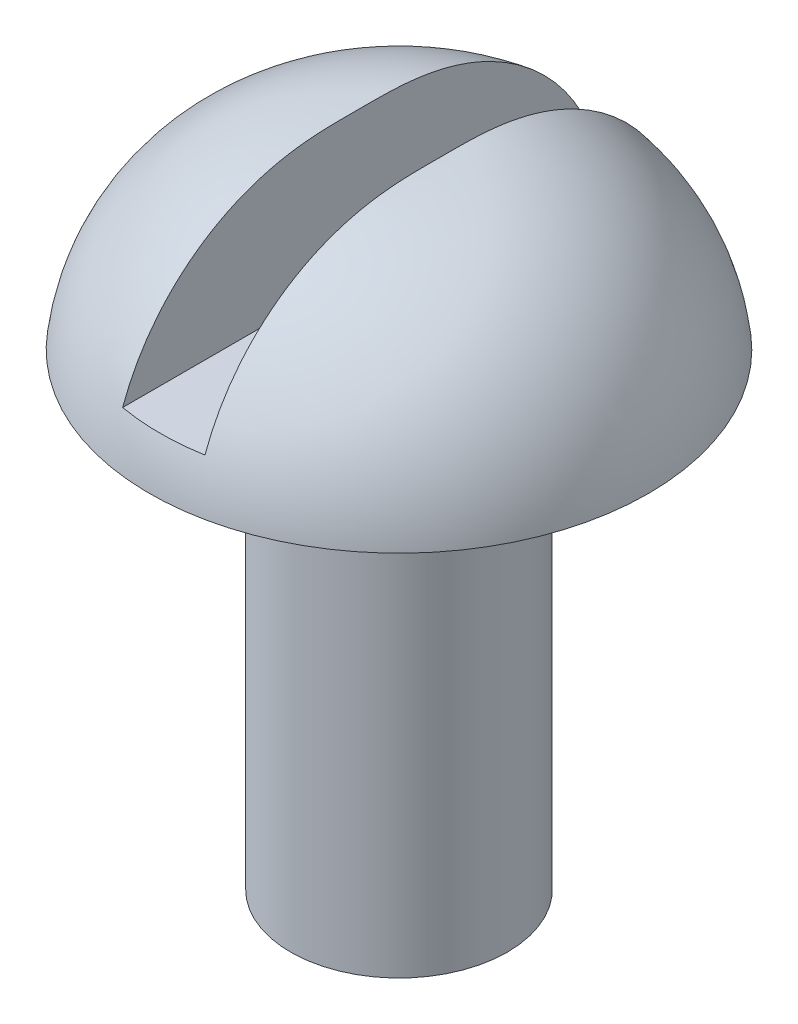
ISO-10303-21;
HEADER;
FILE_DESCRIPTION(('STEP AP214'),'2;1');
FILE_NAME('part.step','',(''),(''),'','','');
FILE_SCHEMA(('AUTOMOTIVE_DESIGN { 1 0 10303 214 1 1 1 1 }'));
ENDSEC;
DATA;
#1=APPLICATION_CONTEXT('core data for automotive mechanical design processes');
#2=APPLICATION_PROTOCOL_DEFINITION('international standard','automotive_design',2000,#1);
#3=PRODUCT_CONTEXT('',#1,'mechanical');
#4=PRODUCT('Part','Part','',(#3));
#5=PRODUCT_RELATED_PRODUCT_CATEGORY('part','',(#4));
#6=PRODUCT_DEFINITION_FORMATION('','',#4);
#7=PRODUCT_DEFINITION_CONTEXT('part definition',#1,'design');
#8=PRODUCT_DEFINITION('design','',#6,#7);
#9=PRODUCT_DEFINITION_SHAPE('','',#8);
#10=(LENGTH_UNIT() NAMED_UNIT(*) SI_UNIT(.MILLI.,.METRE.));
#11=(NAMED_UNIT(*) PLANE_ANGLE_UNIT() SI_UNIT($,.RADIAN.));
#12=(NAMED_UNIT(*) SI_UNIT($,.STERADIAN.) SOLID_ANGLE_UNIT());
#13=UNCERTAINTY_MEASURE_WITH_UNIT(LENGTH_MEASURE(1.E-05),#10,'distance_accuracy_value','');
#14=(GEOMETRIC_REPRESENTATION_CONTEXT(3) GLOBAL_UNCERTAINTY_ASSIGNED_CONTEXT((#13)) GLOBAL_UNIT_ASSIGNED_CONTEXT((#10,
#11,#12)) REPRESENTATION_CONTEXT('',''));
#15=CARTESIAN_POINT('',(0.,0.,0.));
#16=DIRECTION('',(0.,0.,1.));
#17=DIRECTION('',(1.,0.,0.));
#18=AXIS2_PLACEMENT_3D('',#15,#16,#17);
#19=CARTESIAN_POINT('',(0.,-20.32,0.));
#20=DIRECTION('',(0.,-1.,0.));
#21=DIRECTION('',(1.,0.,0.));
#22=AXIS2_PLACEMENT_3D('',#19,#20,#21);
#23=PLANE('',#22);
#24=CARTESIAN_POINT('',(0.,-20.32,0.));
#25=DIRECTION('',(0.,-1.,0.));
#26=DIRECTION('',(1.,0.,0.));
#27=AXIS2_PLACEMENT_3D('',#24,#25,#26);
#28=CIRCLE('',#27,11.781869772002);
#29=CARTESIAN_POINT('',(11.781869772002,-20.32,0.));
#30=VERTEX_POINT('',#29);
#31=EDGE_CURVE('E72',#30,#30,#28,.T.);
#32=ORIENTED_EDGE('',*,*,#31,.F.);
#33=EDGE_LOOP('',(#32));
#34=FACE_BOUND('',#33,.T.);
#35=CARTESIAN_POINT('',(0.,-20.32,0.));
#36=DIRECTION('',(0.,-1.,0.));
#37=DIRECTION('',(1.,0.,0.));
#38=AXIS2_PLACEMENT_3D('',#35,#36,#37);
#39=CIRCLE('',#38,27.1010153402487);
#40=CARTESIAN_POINT('',(27.1010153402487,-20.32,0.));
#41=VERTEX_POINT('',#40);
#42=EDGE_CURVE('E101',#41,#41,#39,.T.);
#43=ORIENTED_EDGE('',*,*,#42,.T.);
#44=EDGE_LOOP('',(#43));
#45=FACE_BOUND('',#44,.T.);
#46=ADVANCED_FACE('F16',(#34,#45),#23,.T.);
#47=CARTESIAN_POINT('',(0.,-71.12,0.));
#48=DIRECTION('',(0.,1.,0.));
#49=DIRECTION('',(0.,0.,1.));
#50=AXIS2_PLACEMENT_3D('',#47,#48,#49);
#51=CYLINDRICAL_SURFACE('',#50,11.781869772002);
#52=CARTESIAN_POINT('',(0.,-71.12,0.));
#53=DIRECTION('',(0.,-1.,0.));
#54=DIRECTION('',(1.,0.,0.));
#55=AXIS2_PLACEMENT_3D('',#52,#53,#54);
#56=CIRCLE('',#55,11.781869772002);
#57=CARTESIAN_POINT('',(11.781869772002,-71.12,0.));
#58=VERTEX_POINT('',#57);
#59=EDGE_CURVE('E102',#58,#58,#56,.T.);
#60=ORIENTED_EDGE('',*,*,#59,.F.);
#61=EDGE_LOOP('',(#60));
#62=FACE_BOUND('',#61,.T.);
#63=ORIENTED_EDGE('',*,*,#31,.T.);
#64=EDGE_LOOP('',(#63));
#65=FACE_BOUND('',#64,.T.);
#66=ADVANCED_FACE('F87',(#62,#65),#51,.T.);
#67=CARTESIAN_POINT('',(0.,-71.12,0.));
#68=DIRECTION('',(0.,-1.,0.));
#69=DIRECTION('',(1.,0.,0.));
#70=AXIS2_PLACEMENT_3D('',#67,#68,#69);
#71=PLANE('',#70);
#72=ORIENTED_EDGE('',*,*,#59,.T.);
#73=EDGE_LOOP('',(#72));
#74=FACE_BOUND('',#73,.T.);
#75=ADVANCED_FACE('F84',(#74),#71,.T.);
#76=CARTESIAN_POINT('',(0.,-22.86,0.));
#77=DIRECTION('',(0.,1.,0.));
#78=DIRECTION('',(0.,0.,1.));
#79=AXIS2_PLACEMENT_3D('',#76,#77,#78);
#80=DEGENERATE_TOROIDAL_SURFACE('',#79,4.38256468885079,22.86,.T.);
#81=CARTESIAN_POINT('',(0.,-15.24,0.));
#82=DIRECTION('',(0.,-1.,0.));
#83=DIRECTION('',(0.,0.,-1.));
#84=AXIS2_PLACEMENT_3D('',#81,#82,#83);
#85=CIRCLE('',#84,25.9351793794168);
#86=CARTESIAN_POINT('',(-4.47057440816206,-15.24,25.5469664325064));
#87=VERTEX_POINT('',#86);
#88=CARTESIAN_POINT('',(4.47057440816206,-15.24,25.5469664325064));
#89=VERTEX_POINT('',#88);
#90=EDGE_CURVE('E10',#87,#89,#85,.F.);
#91=ORIENTED_EDGE('',*,*,#90,.F.);
#92=CARTESIAN_POINT('',(-4.47057440816206,-0.000169416872163819,0.));
#93=CARTESIAN_POINT('',(-4.47057440816206,-0.000170004205082616,-0.186452177686282));
#94=CARTESIAN_POINT('',(-4.47057440816206,-0.000205692443229249,-0.372904313040872));
#95=CARTESIAN_POINT('',(-4.47057440816206,-0.000454693663221782,-0.745808897814872));
#96=CARTESIAN_POINT('',(-4.47057440816206,-0.000668007048835807,-0.932261347234033));
#97=CARTESIAN_POINT('',(-4.47057440816206,-0.00156345430051884,-1.30513529458505));
#98=CARTESIAN_POINT('',(-4.47057440816206,-0.00224551167664613,-1.49155679260391));
#99=CARTESIAN_POINT('',(-4.47057440816206,-0.00449552504806426,-1.86439462540654));
#100=CARTESIAN_POINT('',(-4.47057440816206,-0.0060634838066091,-2.05081096017239));
#101=CARTESIAN_POINT('',(-4.47057440816206,-0.0128159677570617,-2.60961580620854));
#102=CARTESIAN_POINT('',(-4.47057440816206,-0.0200479901937869,-2.98198767227257));
#103=CARTESIAN_POINT('',(-4.47057440816206,-0.043668259838029,-3.72655256883429));
#104=CARTESIAN_POINT('',(-4.47057440816206,-0.0600585991893079,-4.09874553901332));
#105=CARTESIAN_POINT('',(-4.47057440816206,-0.105283512364211,-4.84978964795365));
#106=CARTESIAN_POINT('',(-4.47057440816206,-0.134357761324207,-5.2286269058061));
#107=CARTESIAN_POINT('',(-4.47057440816206,-0.207026278260372,-5.98493660083577));
#108=CARTESIAN_POINT('',(-4.47057440816206,-0.250620878977985,-6.36240900653628));
#109=CARTESIAN_POINT('',(-4.47057440816206,-0.353635006430786,-7.11523404953914));
#110=CARTESIAN_POINT('',(-4.47057440816206,-0.413055760064203,-7.49058652019193));
#111=CARTESIAN_POINT('',(-4.47057440816206,-0.548513786741311,-8.23828016884625));
#112=CARTESIAN_POINT('',(-4.47057440816206,-0.624550543506945,-8.61062144003648));
#113=CARTESIAN_POINT('',(-4.47057440816206,-0.793706388881691,-9.35147183057077));
#114=CARTESIAN_POINT('',(-4.47057440816206,-0.886828084066857,-9.71998035609172));
#115=CARTESIAN_POINT('',(-4.47057440816206,-1.09035728238853,-10.4521980166407));
#116=CARTESIAN_POINT('',(-4.47057440816206,-1.20076487214968,-10.8159071276076));
#117=CARTESIAN_POINT('',(-4.47057440816206,-1.43891660133097,-11.5376386527031));
#118=CARTESIAN_POINT('',(-4.47057440816206,-1.5666616267187,-11.8956607751735));
#119=CARTESIAN_POINT('',(-4.47057440816206,-1.83938296481012,-12.6050896836016));
#120=CARTESIAN_POINT('',(-4.47057440816206,-1.98436099256281,-12.9564958070892));
#121=CARTESIAN_POINT('',(-4.47057440816206,-2.43081453179439,-13.9675593158506));
#122=CARTESIAN_POINT('',(-4.47057440816206,-2.75487298939021,-14.6174254457299));
#123=CARTESIAN_POINT('',(-4.47057440816206,-3.4628682995084,-15.8835298228238));
#124=CARTESIAN_POINT('',(-4.47057440816206,-3.84680246240835,-16.4997695788608));
#125=CARTESIAN_POINT('',(-4.47057440816206,-4.67186700080576,-17.6934819960324));
#126=CARTESIAN_POINT('',(-4.47057440816206,-5.11304406192031,-18.2709224236357));
#127=CARTESIAN_POINT('',(-4.47057440816206,-6.04854103939,-19.3809772503316));
#128=CARTESIAN_POINT('',(-4.47057440816206,-6.54285663242633,-19.9135952898701));
#129=CARTESIAN_POINT('',(-4.47057440816206,-7.52198667171331,-20.8720097942339));
#130=CARTESIAN_POINT('',(-4.47057440816206,-8.00164716730315,-21.3030869567219));
#131=CARTESIAN_POINT('',(-4.47057440816206,-8.99593686185243,-22.1227640840127));
#132=CARTESIAN_POINT('',(-4.47057440816206,-9.51056267258211,-22.5113681550753));
#133=CARTESIAN_POINT('',(-4.47057440816206,-10.5707014778889,-23.242960338425));
#134=CARTESIAN_POINT('',(-4.47057440816206,-11.1161910699646,-23.5859823696045));
#135=CARTESIAN_POINT('',(-4.47057440816206,-12.2344738127243,-24.2242165130004));
#136=CARTESIAN_POINT('',(-4.47057440816206,-12.8072673776157,-24.5194278996195));
#137=CARTESIAN_POINT('',(-4.47057440816206,-13.9690243808801,-25.0566239027366));
#138=CARTESIAN_POINT('',(-4.47057440816206,-14.557714568694,-25.2991996721796));
#139=CARTESIAN_POINT('',(-4.47057440816206,-15.75347342246,-25.7337630376496));
#140=CARTESIAN_POINT('',(-4.47057440816206,-16.3605418336365,-25.9257513346079));
#141=CARTESIAN_POINT('',(-4.47057440816206,-17.5888167963481,-26.2577743051329));
#142=CARTESIAN_POINT('',(-4.47057440816206,-18.2100253599429,-26.3978015352767));
#143=CARTESIAN_POINT('',(-4.47057440816206,-19.4620569228044,-26.6248485726858));
#144=CARTESIAN_POINT('',(-4.47057440816206,-20.0928799360197,-26.7118683030403));
#145=CARTESIAN_POINT('',(-4.47057440816206,-21.3577229730477,-26.8320882293953));
#146=CARTESIAN_POINT('',(-4.47057440816206,-21.9917277365108,-26.8654490390634));
#147=CARTESIAN_POINT('',(-4.47057440816206,-23.2602916572682,-26.8786128457719));
#148=CARTESIAN_POINT('',(-4.47057440816206,-23.8948508128927,-26.8584160035685));
#149=CARTESIAN_POINT('',(-4.47057440816206,-25.1600685254473,-26.7646058797107));
#150=CARTESIAN_POINT('',(-4.47057440816206,-25.7907267075013,-26.6909875423766));
#151=CARTESIAN_POINT('',(-4.47057440816206,-27.0435947936992,-26.4908595465712));
#152=CARTESIAN_POINT('',(-4.47057440816206,-27.6658046905106,-26.3643498421981));
#153=CARTESIAN_POINT('',(-4.47057440816206,-28.8971617664622,-26.0593983378695));
#154=CARTESIAN_POINT('',(-4.47057440816206,-29.5063129004535,-25.8809725062779));
#155=CARTESIAN_POINT('',(-4.47057440816206,-30.7074253747017,-25.4734599720728));
#156=CARTESIAN_POINT('',(-4.47057440816206,-31.2993867431081,-25.2443733524257));
#157=CARTESIAN_POINT('',(-4.47057440816206,-32.4616207760554,-24.7373237132641));
#158=CARTESIAN_POINT('',(-4.47057440816206,-33.0319046878792,-24.4593864726619));
#159=CARTESIAN_POINT('',(-4.47057440816206,-34.1470888873559,-23.8565540022517));
#160=CARTESIAN_POINT('',(-4.47057440816206,-34.6919891158624,-23.5316586630342));
#161=CARTESIAN_POINT('',(-4.47057440816206,-35.7528786690841,-22.8370500745163));
#162=CARTESIAN_POINT('',(-4.47057440816206,-36.2688512318321,-22.4673112254747));
#163=CARTESIAN_POINT('',(-4.47057440816206,-37.2679335475463,-21.6858320871883));
#164=CARTESIAN_POINT('',(-4.47057440816206,-37.7510435547614,-21.2740921229567));
#165=CARTESIAN_POINT('',(-4.47057440816206,-38.6818304658243,-20.4108569513829));
#166=CARTESIAN_POINT('',(-4.47057440816206,-39.1294470900964,-19.9592967508529));
#167=CARTESIAN_POINT('',(-4.47057440816206,-39.9852946382239,-19.0202607345146));
#168=CARTESIAN_POINT('',(-4.47057440816206,-40.393524369047,-18.5327838315746));
#169=CARTESIAN_POINT('',(-4.47057440816206,-41.1700691702907,-17.52255849066));
#170=CARTESIAN_POINT('',(-4.47057440816206,-41.5381421034045,-16.9996239368014));
#171=CARTESIAN_POINT('',(-4.47057440816206,-42.229247065789,-15.9248627512127));
#172=CARTESIAN_POINT('',(-4.47057440816206,-42.5522825910171,-15.3730383665888));
#173=CARTESIAN_POINT('',(-4.47057440816206,-43.1500290513962,-14.2470731668124));
#174=CARTESIAN_POINT('',(-4.47057440816206,-43.4249554481976,-13.673046686241));
#175=CARTESIAN_POINT('',(-4.47057440816206,-43.9269682929392,-12.5043512740191));
#176=CARTESIAN_POINT('',(-4.47057440816206,-44.1540454190374,-11.9096783463289));
#177=CARTESIAN_POINT('',(-4.47057440816206,-44.562584272311,-10.6951374781728));
#178=CARTESIAN_POINT('',(-4.47057440816206,-44.743331438014,-10.0750284250964));
#179=CARTESIAN_POINT('',(-4.47057440816206,-44.9771676180665,-9.13592122194589));
#180=CARTESIAN_POINT('',(-4.47057440816206,-45.0488923036118,-8.82143461255371));
#181=CARTESIAN_POINT('',(-4.47057440816206,-45.1801660246338,-8.18993475593902));
#182=CARTESIAN_POINT('',(-4.47057440816206,-45.2397158378164,-7.87292167144742));
#183=CARTESIAN_POINT('',(-4.47057440816206,-45.3473581972449,-7.23463835354108));
#184=CARTESIAN_POINT('',(-4.47057440816206,-45.395365845449,-6.91335388654686));
#185=CARTESIAN_POINT('',(-4.47057440816206,-45.4799269040816,-6.26928596483018));
#186=CARTESIAN_POINT('',(-4.47057440816206,-45.5164802244803,-5.94650249834599));
#187=CARTESIAN_POINT('',(-4.47057440816206,-45.5789811390182,-5.29979670376044));
#188=CARTESIAN_POINT('',(-4.47057440816206,-45.6049246331834,-4.97587398409194));
#189=CARTESIAN_POINT('',(-4.47057440816206,-45.6474148570386,-4.32740622145068));
#190=CARTESIAN_POINT('',(-4.47057440816206,-45.6639609999151,-4.0028611408843));
#191=CARTESIAN_POINT('',(-4.47057440816206,-45.686740049864,-3.4214152067193));
#192=CARTESIAN_POINT('',(-4.47057440816206,-45.6944063612158,-3.16456700730571));
#193=CARTESIAN_POINT('',(-4.47057440816206,-45.7060627524341,-2.6507982953286));
#194=CARTESIAN_POINT('',(-4.47057440816206,-45.7100529294302,-2.39387778485509));
#195=CARTESIAN_POINT('',(-4.47057440816206,-45.7156081266242,-1.87997889446629));
#196=CARTESIAN_POINT('',(-4.47057440816206,-45.7171728065651,-1.62300051148875));
#197=CARTESIAN_POINT('',(-4.47057440816206,-45.7190958647419,-1.10903961595809));
#198=CARTESIAN_POINT('',(-4.47057440816206,-45.7194542373229,-0.852057103391243));
#199=CARTESIAN_POINT('',(-4.47057440816206,-45.71983548606,-0.337837540965433));
#200=CARTESIAN_POINT('',(-4.47057440816206,-45.7198580295561,-0.080600491109681));
#201=CARTESIAN_POINT('',(-4.47057440816206,-45.7197757456641,0.43387360062501));
#202=CARTESIAN_POINT('',(-4.47057440816206,-45.7196709182843,0.691110642503948));
#203=CARTESIAN_POINT('',(-4.47057440816206,-45.718791323845,1.20558714532913));
#204=CARTESIAN_POINT('',(-4.47057440816206,-45.7180165493429,1.46282660627051));
#205=CARTESIAN_POINT('',(-4.47057440816206,-45.7147191082457,1.9772936831153));
#206=CARTESIAN_POINT('',(-4.47057440816206,-45.7121964648336,2.23452129913058));
#207=CARTESIAN_POINT('',(-4.47057440816206,-45.7041569676624,2.74736511903117));
#208=CARTESIAN_POINT('',(-4.47057440816206,-45.6986584729441,3.00298158084349));
#209=CARTESIAN_POINT('',(-4.47057440816206,-45.6834997392684,3.51409531790868));
#210=CARTESIAN_POINT('',(-4.47057440816206,-45.6738395281105,3.76959259394626));
#211=CARTESIAN_POINT('',(-4.47057440816206,-45.6493664540808,4.28032432045553));
#212=CARTESIAN_POINT('',(-4.47057440816206,-45.6345540356147,4.53555879169176));
#213=CARTESIAN_POINT('',(-4.47057440816206,-45.5989959071053,5.04561964718657));
#214=CARTESIAN_POINT('',(-4.47057440816206,-45.5782501821165,5.30044603041559));
#215=CARTESIAN_POINT('',(-4.47057440816206,-45.5302877476094,5.80889812823799));
#216=CARTESIAN_POINT('',(-4.47057440816206,-45.5030861862883,6.06252525686809));
#217=CARTESIAN_POINT('',(-4.47057440816206,-45.4417553268886,6.56894180680948));
#218=CARTESIAN_POINT('',(-4.47057440816206,-45.4076258944958,6.82173121178279));
#219=CARTESIAN_POINT('',(-4.47057440816206,-45.2943534712782,7.57844065436681));
#220=CARTESIAN_POINT('',(-4.47057440816206,-45.2043195329927,8.08077659881853));
#221=CARTESIAN_POINT('',(-4.47057440816206,-44.9638434350521,9.22025259699726));
#222=CARTESIAN_POINT('',(-4.47057440816206,-44.8035181599196,9.85533720186964));
#223=CARTESIAN_POINT('',(-4.47057440816206,-44.4312165385839,11.1109455216703));
#224=CARTESIAN_POINT('',(-4.47057440816206,-44.2191852262666,11.7314529656299));
#225=CARTESIAN_POINT('',(-4.47057440816206,-43.743887533123,12.9525350234402));
#226=CARTESIAN_POINT('',(-4.47057440816206,-43.480622810016,13.5531102814852));
#227=CARTESIAN_POINT('',(-4.47057440816206,-42.9041919993033,14.7295201579158));
#228=CARTESIAN_POINT('',(-4.47057440816206,-42.5910468290539,15.3053650190408));
#229=CARTESIAN_POINT('',(-4.47057440816206,-41.9162032976617,16.4289331312445));
#230=CARTESIAN_POINT('',(-4.47057440816206,-41.5544402185078,16.9766175291932));
#231=CARTESIAN_POINT('',(-4.47057440816206,-40.7850481550955,18.0389035279089));
#232=CARTESIAN_POINT('',(-4.47057440816206,-40.3774119086646,18.5534998701924));
#233=CARTESIAN_POINT('',(-4.47057440816206,-39.5189005596729,19.5458986495694));
#234=CARTESIAN_POINT('',(-4.47057440816206,-39.0679954475349,20.0236751296647));
#235=CARTESIAN_POINT('',(-4.47057440816206,-38.1264953551839,20.9383212218137));
#236=CARTESIAN_POINT('',(-4.47057440816206,-37.6359030352731,21.3751935715138));
#237=CARTESIAN_POINT('',(-4.47057440816206,-36.6309961537652,22.1946182536935));
#238=CARTESIAN_POINT('',(-4.47057440816206,-36.1175463088944,22.5782316028267));
#239=CARTESIAN_POINT('',(-4.47057440816206,-35.0599509947343,23.3005215999393));
#240=CARTESIAN_POINT('',(-4.47057440816206,-34.5158055916012,23.6391983447626));
#241=CARTESIAN_POINT('',(-4.47057440816206,-33.4009744143298,24.268980882864));
#242=CARTESIAN_POINT('',(-4.47057440816206,-32.8303007495225,24.5601081123625));
#243=CARTESIAN_POINT('',(-4.47057440816206,-31.6662894102701,25.0928398014835));
#244=CARTESIAN_POINT('',(-4.47057440816206,-31.0729518609561,25.3344445344809));
#245=CARTESIAN_POINT('',(-4.47057440816206,-29.8722525446422,25.7647961971003));
#246=CARTESIAN_POINT('',(-4.47057440816206,-29.2650232057606,25.9539126975866));
#247=CARTESIAN_POINT('',(-4.47057440816206,-28.0367712089616,26.2802221825116));
#248=CARTESIAN_POINT('',(-4.47057440816206,-27.4157486144014,26.4174154053996));
#249=CARTESIAN_POINT('',(-4.47057440816206,-26.1642737060952,26.6388977404555));
#250=CARTESIAN_POINT('',(-4.47057440816206,-25.5338204203864,26.7231813605568));
#251=CARTESIAN_POINT('',(-4.47057440816206,-24.2680481402891,26.8382122018814));
#252=CARTESIAN_POINT('',(-4.47057440816206,-23.6327291471752,26.8689594371299));
#253=CARTESIAN_POINT('',(-4.47057440816206,-22.3631211802342,26.8766869138209));
#254=CARTESIAN_POINT('',(-4.47057440816206,-21.7288329007629,26.8537817285592));
#255=CARTESIAN_POINT('',(-4.47057440816206,-20.4644429943957,26.7546071013322));
#256=CARTESIAN_POINT('',(-4.47057440816206,-19.8343413598159,26.6783377573349));
#257=CARTESIAN_POINT('',(-4.47057440816206,-18.5827678838611,26.4729784460571));
#258=CARTESIAN_POINT('',(-4.47057440816206,-17.9612965469124,26.3438854046439));
#259=CARTESIAN_POINT('',(-4.47057440816206,-16.7314368216321,26.0338087917022));
#260=CARTESIAN_POINT('',(-4.47057440816206,-16.1230484397613,25.8528251945486));
#261=CARTESIAN_POINT('',(-4.47057440816206,-14.9236366039123,25.440259379808));
#262=CARTESIAN_POINT('',(-4.47057440816206,-14.33261419563,25.208674122285));
#263=CARTESIAN_POINT('',(-4.47057440816206,-13.1721595722817,24.6965805484789));
#264=CARTESIAN_POINT('',(-4.47057440816206,-12.6027273517796,24.4160722445137));
#265=CARTESIAN_POINT('',(-4.47057440816206,-11.4896849686147,23.808268646203));
#266=CARTESIAN_POINT('',(-4.47057440816206,-10.9460651892813,23.480990961364));
#267=CARTESIAN_POINT('',(-4.47057440816206,-9.88824172181249,22.7819272444299));
#268=CARTESIAN_POINT('',(-4.47057440816206,-9.37403800926037,22.4101412492797));
#269=CARTESIAN_POINT('',(-4.47057440816206,-8.3779999680845,21.6242335855948));
#270=CARTESIAN_POINT('',(-4.47057440816206,-7.89620802981295,21.210058195178));
#271=CARTESIAN_POINT('',(-4.47057440816206,-6.96906077433031,20.3427577870305));
#272=CARTESIAN_POINT('',(-4.47057440816206,-6.52370559904101,19.889632617604));
#273=CARTESIAN_POINT('',(-4.47057440816206,-5.6719604768977,18.9471290002411));
#274=CARTESIAN_POINT('',(-4.47057440816206,-5.26561874079087,18.457706988696));
#275=CARTESIAN_POINT('',(-4.47057440816206,-4.49524010380437,17.4466413409541));
#276=CARTESIAN_POINT('',(-4.47057440816206,-4.13120299004134,16.9249978669208));
#277=CARTESIAN_POINT('',(-4.47057440816206,-3.44536006001159,15.8494821109725));
#278=CARTESIAN_POINT('',(-4.47057440816206,-3.12386942612751,15.2954088801333));
#279=CARTESIAN_POINT('',(-4.47057440816206,-2.528080703319,14.1624457718962));
#280=CARTESIAN_POINT('',(-4.47057440816206,-2.25378329423211,13.5835555371492));
#281=CARTESIAN_POINT('',(-4.47057440816206,-1.75464666877162,12.4073043400779));
#282=CARTESIAN_POINT('',(-4.47057440816206,-1.52963463817306,11.8100165745212));
#283=CARTESIAN_POINT('',(-4.47057440816206,-1.12846675187609,10.5992362745719));
#284=CARTESIAN_POINT('',(-4.47057440816206,-0.952310496155646,9.98574387290474));
#285=CARTESIAN_POINT('',(-4.47057440816206,-0.7069858905462,8.98571541112922));
#286=CARTESIAN_POINT('',(-4.47057440816206,-0.622744881741779,8.60279532720849));
#287=CARTESIAN_POINT('',(-4.47057440816206,-0.472124208194983,7.83342629205598));
#288=CARTESIAN_POINT('',(-4.47057440816206,-0.40574542537085,7.44697716755721));
#289=CARTESIAN_POINT('',(-4.47057440816206,-0.29012048244552,6.67152395091615));
#290=CARTESIAN_POINT('',(-4.47057440816206,-0.240875312559836,6.28251971242762));
#291=CARTESIAN_POINT('',(-4.47057440816206,-0.158263227803852,5.50286589884088));
#292=CARTESIAN_POINT('',(-4.47057440816206,-0.124895676231502,5.11221639035287));
#293=CARTESIAN_POINT('',(-4.47057440816206,-0.0719087489282535,4.32845374322309));
#294=CARTESIAN_POINT('',(-4.47057440816206,-0.0523446520249086,3.93533698887939));
#295=CARTESIAN_POINT('',(-4.47057440816206,-0.0240690244734425,3.14872354825914));
#296=CARTESIAN_POINT('',(-4.47057440816206,-0.015358180696116,2.75522683951339));
#297=CARTESIAN_POINT('',(-4.47057440816206,-0.00448702181003184,1.96810227269197));
#298=CARTESIAN_POINT('',(-4.47057440816206,-0.00232780320880698,1.57447440368873));
#299=CARTESIAN_POINT('',(-4.47057440816206,-0.000746991571829426,0.984039488685567));
#300=CARTESIAN_POINT('',(-4.47057440816206,-0.000496382421477805,0.787231714638979));
#301=CARTESIAN_POINT('',(-4.47057440816206,-0.000207285239554509,0.393615944672953));
#302=CARTESIAN_POINT('',(-4.47057440816206,-0.000168796918090777,0.196807948754186));
#303=CARTESIAN_POINT('',(-4.47057440816206,-0.000169416872163819,0.));
#304=B_SPLINE_CURVE_WITH_KNOTS('',3,(#92,#93,#94,#95,#96,#97,#98,#99,#100,#101,#102,#103,#104,
#105,#106,#107,#108,#109,#110,#111,#112,#113,#114,#115,#116,#117,#118,#119,#120,#121,#122,#123,
#124,#125,#126,#127,#128,#129,#130,#131,#132,#133,#134,#135,#136,#137,#138,#139,#140,#141,#142,
#143,#144,#145,#146,#147,#148,#149,#150,#151,#152,#153,#154,#155,#156,#157,#158,#159,#160,#161,
#162,#163,#164,#165,#166,#167,#168,#169,#170,#171,#172,#173,#174,#175,#176,#177,#178,#179,#180,
#181,#182,#183,#184,#185,#186,#187,#188,#189,#190,#191,#192,#193,#194,#195,#196,#197,#198,#199,
#200,#201,#202,#203,#204,#205,#206,#207,#208,#209,#210,#211,#212,#213,#214,#215,#216,#217,#218,
#219,#220,#221,#222,#223,#224,#225,#226,#227,#228,#229,#230,#231,#232,#233,#234,#235,#236,#237,
#238,#239,#240,#241,#242,#243,#244,#245,#246,#247,#248,#249,#250,#251,#252,#253,#254,#255,#256,
#257,#258,#259,#260,#261,#262,#263,#264,#265,#266,#267,#268,#269,#270,#271,#272,#273,#274,#275,
#276,#277,#278,#279,#280,#281,#282,#283,#284,#285,#286,#287,#288,#289,#290,#291,#292,#293,#294,
#295,#296,#297,#298,#299,#300,#301,#302,#303),.UNSPECIFIED.,.T.,.F.,(4,2,2,2,2,2,2,2,2,2,2,2,2,
2,2,2,2,2,2,2,2,2,2,2,2,2,2,2,2,2,2,2,2,2,2,2,2,2,2,2,2,2,2,2,2,2,2,2,2,2,2,2,2,2,2,2,2,2,2,2,2,
2,2,2,2,2,2,2,2,2,2,2,2,2,2,2,2,2,2,2,2,2,2,2,2,2,2,2,2,2,2,2,2,2,2,2,2,2,2,2,2,2,2,2,2,4),(0.,
0.559356416616733,1.11871410473646,1.67798053817973,2.23724871606518,3.35450260347486,
4.47201182294722,5.61161977322585,6.75125384001271,7.89097628091098,9.03066331437459,
10.1705243698276,11.310391137639,12.4503161762097,13.5903547566167,15.7654160089213,
17.9403795853936,20.117128280731,22.2937000109542,24.2261222196581,26.1583574379743,
28.0891466758415,30.0199652135473,31.9278254287012,33.8356592074813,35.7437661780507,
37.6518759171687,39.5542635380667,41.4566454488568,43.3592074199047,45.2617710420954,
47.1637500912039,49.0657260254982,50.9667012670819,52.8676809378932,54.7697509714662,
56.6718062875507,58.5770256588199,60.4823027212337,62.3984980012011,64.3145444566411,
66.2217769307588,68.1293806229853,70.0648416414916,71.0323311613937,71.9997588607316,
72.9740985001072,73.9484457974885,74.9231692586556,75.8979535793185,76.6688097608496,
77.4396455744453,78.2105895136743,78.9815370668961,79.7532482417467,80.524959365886,
81.2966790633044,82.0683885251695,82.835390434273,83.6023872200483,84.369317864603,
85.1362504409997,85.9014009484627,86.6665662917289,88.1966723408132,90.1595263156413,
92.1244760692009,94.0893622549872,96.0534266249005,98.020131856883,99.9871488767612,
101.955540140283,103.923799568286,105.844289219739,107.76477473223,109.684392049418,
111.603998769617,113.50972524286,115.41544296426,117.32135846826,119.227273472959,
121.129122159304,123.030967354166,124.932923244725,126.834880074526,128.736951197361,
130.639021841287,132.54037819941,134.441732979287,136.34552798791,138.249330411494,
140.155455963715,142.061571923604,143.981100169073,145.900656063811,147.81336947419,
149.726067223164,150.901914821993,152.07782046573,153.253794058164,154.429720489374,
155.610329837624,156.791013899408,157.971895554543,158.562320084792,159.152743808145),.UNSPECIFIED.);
#305=CARTESIAN_POINT('',(-4.47057440816206,-15.24,-25.5469664325064));
#306=VERTEX_POINT('',#305);
#307=EDGE_CURVE('E21',#87,#306,#304,.T.);
#308=ORIENTED_EDGE('',*,*,#307,.T.);
#309=CARTESIAN_POINT('',(4.47057440816206,-15.24,-25.5469664325064));
#310=VERTEX_POINT('',#309);
#311=EDGE_CURVE('E31',#310,#306,#85,.F.);
#312=ORIENTED_EDGE('',*,*,#311,.F.);
#313=CARTESIAN_POINT('',(4.47057440816206,-0.000169416872163819,0.));
#314=CARTESIAN_POINT('',(4.47057440816206,-0.000170004205082616,-0.186452177686282));
#315=CARTESIAN_POINT('',(4.47057440816206,-0.000205692443229249,-0.372904313040872));
#316=CARTESIAN_POINT('',(4.47057440816206,-0.000454693663221782,-0.745808897814872));
#317=CARTESIAN_POINT('',(4.47057440816206,-0.000668007048835807,-0.932261347234033));
#318=CARTESIAN_POINT('',(4.47057440816206,-0.00156345430051884,-1.30513529458505));
#319=CARTESIAN_POINT('',(4.47057440816206,-0.00224551167664613,-1.49155679260391));
#320=CARTESIAN_POINT('',(4.47057440816206,-0.00449552504806426,-1.86439462540654));
#321=CARTESIAN_POINT('',(4.47057440816206,-0.0060634838066091,-2.05081096017239));
#322=CARTESIAN_POINT('',(4.47057440816206,-0.0128159677570617,-2.60961580620854));
#323=CARTESIAN_POINT('',(4.47057440816206,-0.0200479901937869,-2.98198767227257));
#324=CARTESIAN_POINT('',(4.47057440816206,-0.043668259838029,-3.72655256883429));
#325=CARTESIAN_POINT('',(4.47057440816206,-0.0600585991893079,-4.09874553901332));
#326=CARTESIAN_POINT('',(4.47057440816206,-0.105283512364211,-4.84978964795365));
#327=CARTESIAN_POINT('',(4.47057440816206,-0.134357761324207,-5.2286269058061));
#328=CARTESIAN_POINT('',(4.47057440816206,-0.207026278260372,-5.98493660083577));
#329=CARTESIAN_POINT('',(4.47057440816206,-0.250620878977985,-6.36240900653628));
#330=CARTESIAN_POINT('',(4.47057440816206,-0.353635006430786,-7.11523404953914));
#331=CARTESIAN_POINT('',(4.47057440816206,-0.413055760064203,-7.49058652019193));
#332=CARTESIAN_POINT('',(4.47057440816206,-0.548513786741311,-8.23828016884625));
#333=CARTESIAN_POINT('',(4.47057440816206,-0.624550543506945,-8.61062144003648));
#334=CARTESIAN_POINT('',(4.47057440816206,-0.793706388881691,-9.35147183057077));
#335=CARTESIAN_POINT('',(4.47057440816206,-0.886828084066857,-9.71998035609172));
#336=CARTESIAN_POINT('',(4.47057440816206,-1.09035728238853,-10.4521980166407));
#337=CARTESIAN_POINT('',(4.47057440816206,-1.20076487214968,-10.8159071276076));
#338=CARTESIAN_POINT('',(4.47057440816206,-1.43891660133097,-11.5376386527031));
#339=CARTESIAN_POINT('',(4.47057440816206,-1.5666616267187,-11.8956607751735));
#340=CARTESIAN_POINT('',(4.47057440816206,-1.83938296481012,-12.6050896836016));
#341=CARTESIAN_POINT('',(4.47057440816206,-1.98436099256281,-12.9564958070892));
#342=CARTESIAN_POINT('',(4.47057440816206,-2.43081453179439,-13.9675593158506));
#343=CARTESIAN_POINT('',(4.47057440816206,-2.75487298939021,-14.6174254457299));
#344=CARTESIAN_POINT('',(4.47057440816206,-3.4628682995084,-15.8835298228238));
#345=CARTESIAN_POINT('',(4.47057440816206,-3.84680246240835,-16.4997695788608));
#346=CARTESIAN_POINT('',(4.47057440816206,-4.67186700080576,-17.6934819960324));
#347=CARTESIAN_POINT('',(4.47057440816206,-5.11304406192031,-18.2709224236357));
#348=CARTESIAN_POINT('',(4.47057440816206,-6.04854103939,-19.3809772503316));
#349=CARTESIAN_POINT('',(4.47057440816206,-6.54285663242633,-19.9135952898701));
#350=CARTESIAN_POINT('',(4.47057440816206,-7.52198667171331,-20.8720097942339));
#351=CARTESIAN_POINT('',(4.47057440816206,-8.00164716730315,-21.3030869567219));
#352=CARTESIAN_POINT('',(4.47057440816206,-8.99593686185243,-22.1227640840127));
#353=CARTESIAN_POINT('',(4.47057440816206,-9.51056267258211,-22.5113681550753));
#354=CARTESIAN_POINT('',(4.47057440816206,-10.5707014778889,-23.242960338425));
#355=CARTESIAN_POINT('',(4.47057440816206,-11.1161910699646,-23.5859823696045));
#356=CARTESIAN_POINT('',(4.47057440816206,-12.2344738127243,-24.2242165130004));
#357=CARTESIAN_POINT('',(4.47057440816206,-12.8072673776157,-24.5194278996195));
#358=CARTESIAN_POINT('',(4.47057440816206,-13.9690243808801,-25.0566239027366));
#359=CARTESIAN_POINT('',(4.47057440816206,-14.557714568694,-25.2991996721796));
#360=CARTESIAN_POINT('',(4.47057440816206,-15.75347342246,-25.7337630376496));
#361=CARTESIAN_POINT('',(4.47057440816206,-16.3605418336365,-25.9257513346079));
#362=CARTESIAN_POINT('',(4.47057440816206,-17.5888167963481,-26.2577743051329));
#363=CARTESIAN_POINT('',(4.47057440816206,-18.2100253599429,-26.3978015352767));
#364=CARTESIAN_POINT('',(4.47057440816206,-19.4620569228044,-26.6248485726858));
#365=CARTESIAN_POINT('',(4.47057440816206,-20.0928799360197,-26.7118683030403));
#366=CARTESIAN_POINT('',(4.47057440816206,-21.3577229730477,-26.8320882293953));
#367=CARTESIAN_POINT('',(4.47057440816206,-21.9917277365108,-26.8654490390634));
#368=CARTESIAN_POINT('',(4.47057440816206,-23.2602916572682,-26.8786128457719));
#369=CARTESIAN_POINT('',(4.47057440816206,-23.8948508128927,-26.8584160035685));
#370=CARTESIAN_POINT('',(4.47057440816206,-25.1600685254473,-26.7646058797107));
#371=CARTESIAN_POINT('',(4.47057440816206,-25.7907267075013,-26.6909875423766));
#372=CARTESIAN_POINT('',(4.47057440816206,-27.0435947936992,-26.4908595465712));
#373=CARTESIAN_POINT('',(4.47057440816206,-27.6658046905106,-26.3643498421981));
#374=CARTESIAN_POINT('',(4.47057440816206,-28.8971617664622,-26.0593983378695));
#375=CARTESIAN_POINT('',(4.47057440816206,-29.5063129004535,-25.8809725062779));
#376=CARTESIAN_POINT('',(4.47057440816206,-30.7074253747017,-25.4734599720728));
#377=CARTESIAN_POINT('',(4.47057440816206,-31.2993867431081,-25.2443733524257));
#378=CARTESIAN_POINT('',(4.47057440816206,-32.4616207760554,-24.7373237132641));
#379=CARTESIAN_POINT('',(4.47057440816206,-33.0319046878792,-24.4593864726619));
#380=CARTESIAN_POINT('',(4.47057440816206,-34.1470888873559,-23.8565540022517));
#381=CARTESIAN_POINT('',(4.47057440816206,-34.6919891158624,-23.5316586630342));
#382=CARTESIAN_POINT('',(4.47057440816206,-35.7528786690841,-22.8370500745163));
#383=CARTESIAN_POINT('',(4.47057440816206,-36.2688512318321,-22.4673112254747));
#384=CARTESIAN_POINT('',(4.47057440816206,-37.2679335475463,-21.6858320871883));
#385=CARTESIAN_POINT('',(4.47057440816206,-37.7510435547614,-21.2740921229567));
#386=CARTESIAN_POINT('',(4.47057440816206,-38.6818304658243,-20.4108569513829));
#387=CARTESIAN_POINT('',(4.47057440816206,-39.1294470900964,-19.9592967508529));
#388=CARTESIAN_POINT('',(4.47057440816206,-39.9852946382239,-19.0202607345146));
#389=CARTESIAN_POINT('',(4.47057440816206,-40.393524369047,-18.5327838315746));
#390=CARTESIAN_POINT('',(4.47057440816206,-41.1700691702907,-17.52255849066));
#391=CARTESIAN_POINT('',(4.47057440816206,-41.5381421034045,-16.9996239368014));
#392=CARTESIAN_POINT('',(4.47057440816206,-42.229247065789,-15.9248627512127));
#393=CARTESIAN_POINT('',(4.47057440816206,-42.5522825910171,-15.3730383665888));
#394=CARTESIAN_POINT('',(4.47057440816206,-43.1500290513962,-14.2470731668124));
#395=CARTESIAN_POINT('',(4.47057440816206,-43.4249554481976,-13.673046686241));
#396=CARTESIAN_POINT('',(4.47057440816206,-43.9269682929392,-12.5043512740191));
#397=CARTESIAN_POINT('',(4.47057440816206,-44.1540454190374,-11.9096783463289));
#398=CARTESIAN_POINT('',(4.47057440816206,-44.562584272311,-10.6951374781728));
#399=CARTESIAN_POINT('',(4.47057440816206,-44.743331438014,-10.0750284250964));
#400=CARTESIAN_POINT('',(4.47057440816206,-44.9771676180665,-9.13592122194589));
#401=CARTESIAN_POINT('',(4.47057440816206,-45.0488923036118,-8.82143461255371));
#402=CARTESIAN_POINT('',(4.47057440816206,-45.1801660246338,-8.18993475593902));
#403=CARTESIAN_POINT('',(4.47057440816206,-45.2397158378164,-7.87292167144742));
#404=CARTESIAN_POINT('',(4.47057440816206,-45.3473581972449,-7.23463835354108));
#405=CARTESIAN_POINT('',(4.47057440816206,-45.395365845449,-6.91335388654686));
#406=CARTESIAN_POINT('',(4.47057440816206,-45.4799269040816,-6.26928596483018));
#407=CARTESIAN_POINT('',(4.47057440816206,-45.5164802244803,-5.94650249834599));
#408=CARTESIAN_POINT('',(4.47057440816206,-45.5789811390182,-5.29979670376044));
#409=CARTESIAN_POINT('',(4.47057440816206,-45.6049246331834,-4.97587398409194));
#410=CARTESIAN_POINT('',(4.47057440816206,-45.6474148570386,-4.32740622145068));
#411=CARTESIAN_POINT('',(4.47057440816206,-45.6639609999151,-4.0028611408843));
#412=CARTESIAN_POINT('',(4.47057440816206,-45.686740049864,-3.4214152067193));
#413=CARTESIAN_POINT('',(4.47057440816206,-45.6944063612158,-3.16456700730571));
#414=CARTESIAN_POINT('',(4.47057440816206,-45.7060627524341,-2.6507982953286));
#415=CARTESIAN_POINT('',(4.47057440816206,-45.7100529294302,-2.39387778485509));
#416=CARTESIAN_POINT('',(4.47057440816206,-45.7156081266242,-1.87997889446629));
#417=CARTESIAN_POINT('',(4.47057440816206,-45.7171728065651,-1.62300051148875));
#418=CARTESIAN_POINT('',(4.47057440816206,-45.7190958647419,-1.10903961595809));
#419=CARTESIAN_POINT('',(4.47057440816206,-45.7194542373229,-0.852057103391243));
#420=CARTESIAN_POINT('',(4.47057440816206,-45.71983548606,-0.337837540965433));
#421=CARTESIAN_POINT('',(4.47057440816206,-45.7198580295561,-0.080600491109681));
#422=CARTESIAN_POINT('',(4.47057440816206,-45.7197757456641,0.43387360062501));
#423=CARTESIAN_POINT('',(4.47057440816206,-45.7196709182843,0.691110642503948));
#424=CARTESIAN_POINT('',(4.47057440816206,-45.718791323845,1.20558714532913));
#425=CARTESIAN_POINT('',(4.47057440816206,-45.7180165493429,1.46282660627051));
#426=CARTESIAN_POINT('',(4.47057440816206,-45.7147191082457,1.9772936831153));
#427=CARTESIAN_POINT('',(4.47057440816206,-45.7121964648336,2.23452129913058));
#428=CARTESIAN_POINT('',(4.47057440816206,-45.7041569676624,2.74736511903117));
#429=CARTESIAN_POINT('',(4.47057440816206,-45.6986584729441,3.00298158084349));
#430=CARTESIAN_POINT('',(4.47057440816206,-45.6834997392684,3.51409531790868));
#431=CARTESIAN_POINT('',(4.47057440816206,-45.6738395281105,3.76959259394626));
#432=CARTESIAN_POINT('',(4.47057440816206,-45.6493664540808,4.28032432045553));
#433=CARTESIAN_POINT('',(4.47057440816206,-45.6345540356147,4.53555879169176));
#434=CARTESIAN_POINT('',(4.47057440816206,-45.5989959071053,5.04561964718657));
#435=CARTESIAN_POINT('',(4.47057440816206,-45.5782501821165,5.30044603041559));
#436=CARTESIAN_POINT('',(4.47057440816206,-45.5302877476094,5.80889812823799));
#437=CARTESIAN_POINT('',(4.47057440816206,-45.5030861862883,6.06252525686809));
#438=CARTESIAN_POINT('',(4.47057440816206,-45.4417553268886,6.56894180680948));
#439=CARTESIAN_POINT('',(4.47057440816206,-45.4076258944958,6.82173121178279));
#440=CARTESIAN_POINT('',(4.47057440816206,-45.2943534712782,7.57844065436681));
#441=CARTESIAN_POINT('',(4.47057440816206,-45.2043195329927,8.08077659881853));
#442=CARTESIAN_POINT('',(4.47057440816206,-44.9638434350521,9.22025259699726));
#443=CARTESIAN_POINT('',(4.47057440816206,-44.8035181599196,9.85533720186964));
#444=CARTESIAN_POINT('',(4.47057440816206,-44.4312165385839,11.1109455216703));
#445=CARTESIAN_POINT('',(4.47057440816206,-44.2191852262666,11.7314529656299));
#446=CARTESIAN_POINT('',(4.47057440816206,-43.743887533123,12.9525350234402));
#447=CARTESIAN_POINT('',(4.47057440816206,-43.480622810016,13.5531102814852));
#448=CARTESIAN_POINT('',(4.47057440816206,-42.9041919993033,14.7295201579158));
#449=CARTESIAN_POINT('',(4.47057440816206,-42.5910468290539,15.3053650190408));
#450=CARTESIAN_POINT('',(4.47057440816206,-41.9162032976617,16.4289331312445));
#451=CARTESIAN_POINT('',(4.47057440816206,-41.5544402185078,16.9766175291932));
#452=CARTESIAN_POINT('',(4.47057440816206,-40.7850481550955,18.0389035279089));
#453=CARTESIAN_POINT('',(4.47057440816206,-40.3774119086646,18.5534998701924));
#454=CARTESIAN_POINT('',(4.47057440816206,-39.5189005596729,19.5458986495694));
#455=CARTESIAN_POINT('',(4.47057440816206,-39.0679954475349,20.0236751296647));
#456=CARTESIAN_POINT('',(4.47057440816206,-38.1264953551839,20.9383212218137));
#457=CARTESIAN_POINT('',(4.47057440816206,-37.6359030352731,21.3751935715138));
#458=CARTESIAN_POINT('',(4.47057440816206,-36.6309961537652,22.1946182536935));
#459=CARTESIAN_POINT('',(4.47057440816206,-36.1175463088944,22.5782316028267));
#460=CARTESIAN_POINT('',(4.47057440816206,-35.0599509947343,23.3005215999393));
#461=CARTESIAN_POINT('',(4.47057440816206,-34.5158055916012,23.6391983447626));
#462=CARTESIAN_POINT('',(4.47057440816206,-33.4009744143298,24.268980882864));
#463=CARTESIAN_POINT('',(4.47057440816206,-32.8303007495225,24.5601081123625));
#464=CARTESIAN_POINT('',(4.47057440816206,-31.6662894102701,25.0928398014835));
#465=CARTESIAN_POINT('',(4.47057440816206,-31.0729518609561,25.3344445344809));
#466=CARTESIAN_POINT('',(4.47057440816206,-29.8722525446422,25.7647961971003));
#467=CARTESIAN_POINT('',(4.47057440816206,-29.2650232057606,25.9539126975866));
#468=CARTESIAN_POINT('',(4.47057440816206,-28.0367712089616,26.2802221825116));
#469=CARTESIAN_POINT('',(4.47057440816206,-27.4157486144014,26.4174154053996));
#470=CARTESIAN_POINT('',(4.47057440816206,-26.1642737060952,26.6388977404555));
#471=CARTESIAN_POINT('',(4.47057440816206,-25.5338204203864,26.7231813605568));
#472=CARTESIAN_POINT('',(4.47057440816206,-24.2680481402891,26.8382122018814));
#473=CARTESIAN_POINT('',(4.47057440816206,-23.6327291471752,26.8689594371299));
#474=CARTESIAN_POINT('',(4.47057440816206,-22.3631211802342,26.8766869138209));
#475=CARTESIAN_POINT('',(4.47057440816206,-21.7288329007629,26.8537817285592));
#476=CARTESIAN_POINT('',(4.47057440816206,-20.4644429943957,26.7546071013322));
#477=CARTESIAN_POINT('',(4.47057440816206,-19.8343413598159,26.6783377573349));
#478=CARTESIAN_POINT('',(4.47057440816206,-18.5827678838611,26.4729784460571));
#479=CARTESIAN_POINT('',(4.47057440816206,-17.9612965469124,26.3438854046439));
#480=CARTESIAN_POINT('',(4.47057440816206,-16.7314368216321,26.0338087917022));
#481=CARTESIAN_POINT('',(4.47057440816206,-16.1230484397613,25.8528251945486));
#482=CARTESIAN_POINT('',(4.47057440816206,-14.9236366039123,25.440259379808));
#483=CARTESIAN_POINT('',(4.47057440816206,-14.33261419563,25.208674122285));
#484=CARTESIAN_POINT('',(4.47057440816206,-13.1721595722817,24.6965805484789));
#485=CARTESIAN_POINT('',(4.47057440816206,-12.6027273517796,24.4160722445137));
#486=CARTESIAN_POINT('',(4.47057440816206,-11.4896849686147,23.808268646203));
#487=CARTESIAN_POINT('',(4.47057440816206,-10.9460651892813,23.480990961364));
#488=CARTESIAN_POINT('',(4.47057440816206,-9.88824172181249,22.7819272444299));
#489=CARTESIAN_POINT('',(4.47057440816206,-9.37403800926037,22.4101412492797));
#490=CARTESIAN_POINT('',(4.47057440816206,-8.3779999680845,21.6242335855948));
#491=CARTESIAN_POINT('',(4.47057440816206,-7.89620802981295,21.210058195178));
#492=CARTESIAN_POINT('',(4.47057440816206,-6.96906077433031,20.3427577870305));
#493=CARTESIAN_POINT('',(4.47057440816206,-6.52370559904101,19.889632617604));
#494=CARTESIAN_POINT('',(4.47057440816206,-5.6719604768977,18.9471290002411));
#495=CARTESIAN_POINT('',(4.47057440816206,-5.26561874079087,18.457706988696));
#496=CARTESIAN_POINT('',(4.47057440816206,-4.49524010380437,17.4466413409541));
#497=CARTESIAN_POINT('',(4.47057440816206,-4.13120299004134,16.9249978669208));
#498=CARTESIAN_POINT('',(4.47057440816206,-3.44536006001159,15.8494821109725));
#499=CARTESIAN_POINT('',(4.47057440816206,-3.12386942612751,15.2954088801333));
#500=CARTESIAN_POINT('',(4.47057440816206,-2.528080703319,14.1624457718962));
#501=CARTESIAN_POINT('',(4.47057440816206,-2.25378329423211,13.5835555371492));
#502=CARTESIAN_POINT('',(4.47057440816206,-1.75464666877162,12.4073043400779));
#503=CARTESIAN_POINT('',(4.47057440816206,-1.52963463817306,11.8100165745212));
#504=CARTESIAN_POINT('',(4.47057440816206,-1.12846675187609,10.5992362745719));
#505=CARTESIAN_POINT('',(4.47057440816206,-0.952310496155646,9.98574387290474));
#506=CARTESIAN_POINT('',(4.47057440816206,-0.7069858905462,8.98571541112922));
#507=CARTESIAN_POINT('',(4.47057440816206,-0.622744881741779,8.60279532720849));
#508=CARTESIAN_POINT('',(4.47057440816206,-0.472124208194983,7.83342629205598));
#509=CARTESIAN_POINT('',(4.47057440816206,-0.40574542537085,7.44697716755721));
#510=CARTESIAN_POINT('',(4.47057440816206,-0.29012048244552,6.67152395091615));
#511=CARTESIAN_POINT('',(4.47057440816206,-0.240875312559836,6.28251971242762));
#512=CARTESIAN_POINT('',(4.47057440816206,-0.158263227803852,5.50286589884088));
#513=CARTESIAN_POINT('',(4.47057440816206,-0.124895676231502,5.11221639035287));
#514=CARTESIAN_POINT('',(4.47057440816206,-0.0719087489282535,4.32845374322309));
#515=CARTESIAN_POINT('',(4.47057440816206,-0.0523446520249086,3.93533698887939));
#516=CARTESIAN_POINT('',(4.47057440816206,-0.0240690244734425,3.14872354825914));
#517=CARTESIAN_POINT('',(4.47057440816206,-0.015358180696116,2.75522683951339));
#518=CARTESIAN_POINT('',(4.47057440816206,-0.00448702181003184,1.96810227269197));
#519=CARTESIAN_POINT('',(4.47057440816206,-0.00232780320880698,1.57447440368873));
#520=CARTESIAN_POINT('',(4.47057440816206,-0.000746991571829426,0.984039488685567));
#521=CARTESIAN_POINT('',(4.47057440816206,-0.000496382421477805,0.787231714638979));
#522=CARTESIAN_POINT('',(4.47057440816206,-0.000207285239554509,0.393615944672953));
#523=CARTESIAN_POINT('',(4.47057440816206,-0.000168796918090777,0.196807948754186));
#524=CARTESIAN_POINT('',(4.47057440816206,-0.000169416872163819,0.));
#525=B_SPLINE_CURVE_WITH_KNOTS('',3,(#313,#314,#315,#316,#317,#318,#319,#320,#321,#322,#323,
#324,#325,#326,#327,#328,#329,#330,#331,#332,#333,#334,#335,#336,#337,#338,#339,#340,#341,#342,
#343,#344,#345,#346,#347,#348,#349,#350,#351,#352,#353,#354,#355,#356,#357,#358,#359,#360,#361,
#362,#363,#364,#365,#366,#367,#368,#369,#370,#371,#372,#373,#374,#375,#376,#377,#378,#379,#380,
#381,#382,#383,#384,#385,#386,#387,#388,#389,#390,#391,#392,#393,#394,#395,#396,#397,#398,#399,
#400,#401,#402,#403,#404,#405,#406,#407,#408,#409,#410,#411,#412,#413,#414,#415,#416,#417,#418,
#419,#420,#421,#422,#423,#424,#425,#426,#427,#428,#429,#430,#431,#432,#433,#434,#435,#436,#437,
#438,#439,#440,#441,#442,#443,#444,#445,#446,#447,#448,#449,#450,#451,#452,#453,#454,#455,#456,
#457,#458,#459,#460,#461,#462,#463,#464,#465,#466,#467,#468,#469,#470,#471,#472,#473,#474,#475,
#476,#477,#478,#479,#480,#481,#482,#483,#484,#485,#486,#487,#488,#489,#490,#491,#492,#493,#494,
#495,#496,#497,#498,#499,#500,#501,#502,#503,#504,#505,#506,#507,#508,#509,#510,#511,#512,#513,
#514,#515,#516,#517,#518,#519,#520,#521,#522,#523,#524),.UNSPECIFIED.,.T.,.F.,(4,2,2,2,2,2,2,2,
2,2,2,2,2,2,2,2,2,2,2,2,2,2,2,2,2,2,2,2,2,2,2,2,2,2,2,2,2,2,2,2,2,2,2,2,2,2,2,2,2,2,2,2,2,2,2,2,
2,2,2,2,2,2,2,2,2,2,2,2,2,2,2,2,2,2,2,2,2,2,2,2,2,2,2,2,2,2,2,2,2,2,2,2,2,2,2,2,2,2,2,2,2,2,2,2,
2,4),(0.,0.559356416616733,1.11871410473646,1.67798053817973,2.23724871606518,3.35450260347486,
4.47201182294722,5.61161977322585,6.75125384001271,7.89097628091098,9.03066331437459,
10.1705243698276,11.310391137639,12.4503161762097,13.5903547566167,15.7654160089213,
17.9403795853936,20.117128280731,22.2937000109542,24.2261222196581,26.1583574379743,
28.0891466758415,30.0199652135473,31.9278254287012,33.8356592074813,35.7437661780507,
37.6518759171687,39.5542635380667,41.4566454488568,43.3592074199047,45.2617710420954,
47.1637500912039,49.0657260254982,50.9667012670819,52.8676809378932,54.7697509714662,
56.6718062875507,58.5770256588199,60.4823027212337,62.3984980012011,64.3145444566411,
66.2217769307588,68.1293806229853,70.0648416414916,71.0323311613937,71.9997588607316,
72.9740985001072,73.9484457974885,74.9231692586556,75.8979535793185,76.6688097608496,
77.4396455744453,78.2105895136743,78.9815370668961,79.7532482417467,80.524959365886,
81.2966790633044,82.0683885251695,82.835390434273,83.6023872200483,84.369317864603,
85.1362504409997,85.9014009484627,86.6665662917289,88.1966723408132,90.1595263156413,
92.1244760692009,94.0893622549872,96.0534266249005,98.020131856883,99.9871488767612,
101.955540140283,103.923799568286,105.844289219739,107.76477473223,109.684392049418,
111.603998769617,113.50972524286,115.41544296426,117.32135846826,119.227273472959,
121.129122159304,123.030967354166,124.932923244725,126.834880074526,128.736951197361,
130.639021841287,132.54037819941,134.441732979287,136.34552798791,138.249330411494,
140.155455963715,142.061571923604,143.981100169073,145.900656063811,147.81336947419,
149.726067223164,150.901914821993,152.07782046573,153.253794058164,154.429720489374,
155.610329837624,156.791013899408,157.971895554543,158.562320084792,159.152743808145),.UNSPECIFIED.);
#526=EDGE_CURVE('E63',#89,#310,#525,.T.);
#527=ORIENTED_EDGE('',*,*,#526,.F.);
#528=EDGE_LOOP('',(#91,#308,#312,#527));
#529=FACE_BOUND('',#528,.T.);
#530=ORIENTED_EDGE('',*,*,#42,.F.);
#531=EDGE_LOOP('',(#530));
#532=FACE_BOUND('',#531,.T.);
#533=ADVANCED_FACE('F18',(#529,#532),#80,.T.);
#534=CARTESIAN_POINT('',(-4.47057440816206,-15.24,0.));
#535=DIRECTION('',(1.,0.,0.));
#536=DIRECTION('',(0.,0.,-1.));
#537=AXIS2_PLACEMENT_3D('',#534,#535,#536);
#538=PLANE('',#537);
#539=DIRECTION('',(0.,0.,-1.));
#540=VECTOR('',#539,1.);
#541=CARTESIAN_POINT('',(-4.47057440816206,-15.24,0.));
#542=LINE('',#541,#540);
#543=EDGE_CURVE('E59',#87,#306,#542,.T.);
#544=ORIENTED_EDGE('',*,*,#543,.T.);
#545=ORIENTED_EDGE('',*,*,#307,.F.);
#546=EDGE_LOOP('',(#544,#545));
#547=FACE_BOUND('',#546,.T.);
#548=ADVANCED_FACE('F58',(#547),#538,.T.);
#549=CARTESIAN_POINT('',(4.47057440816206,-15.24,0.));
#550=DIRECTION('',(1.,0.,0.));
#551=DIRECTION('',(0.,0.,-1.));
#552=AXIS2_PLACEMENT_3D('',#549,#550,#551);
#553=PLANE('',#552);
#554=ORIENTED_EDGE('',*,*,#526,.T.);
#555=DIRECTION('',(0.,0.,-1.));
#556=VECTOR('',#555,1.);
#557=CARTESIAN_POINT('',(4.47057440816206,-15.24,0.));
#558=LINE('',#557,#556);
#559=EDGE_CURVE('E42',#89,#310,#558,.T.);
#560=ORIENTED_EDGE('',*,*,#559,.F.);
#561=EDGE_LOOP('',(#554,#560));
#562=FACE_BOUND('',#561,.T.);
#563=ADVANCED_FACE('F77',(#562),#553,.F.);
#564=CARTESIAN_POINT('',(0.,-15.24,0.));
#565=DIRECTION('',(0.,-1.,0.));
#566=DIRECTION('',(1.,0.,0.));
#567=AXIS2_PLACEMENT_3D('',#564,#565,#566);
#568=PLANE('',#567);
#569=ORIENTED_EDGE('',*,*,#90,.T.);
#570=ORIENTED_EDGE('',*,*,#559,.T.);
#571=ORIENTED_EDGE('',*,*,#311,.T.);
#572=ORIENTED_EDGE('',*,*,#543,.F.);
#573=EDGE_LOOP('',(#569,#570,#571,#572));
#574=FACE_BOUND('',#573,.T.);
#575=ADVANCED_FACE('F64',(#574),#568,.F.);
#576=CLOSED_SHELL('',(#46,#66,#75,#533,#548,#563,#575));
#577=MANIFOLD_SOLID_BREP('B1',#576);
#578=ADVANCED_BREP_SHAPE_REPRESENTATION('',(#18,#577),#14);
#579=SHAPE_DEFINITION_REPRESENTATION(#9,#578);
ENDSEC;
END-ISO-10303-21;
